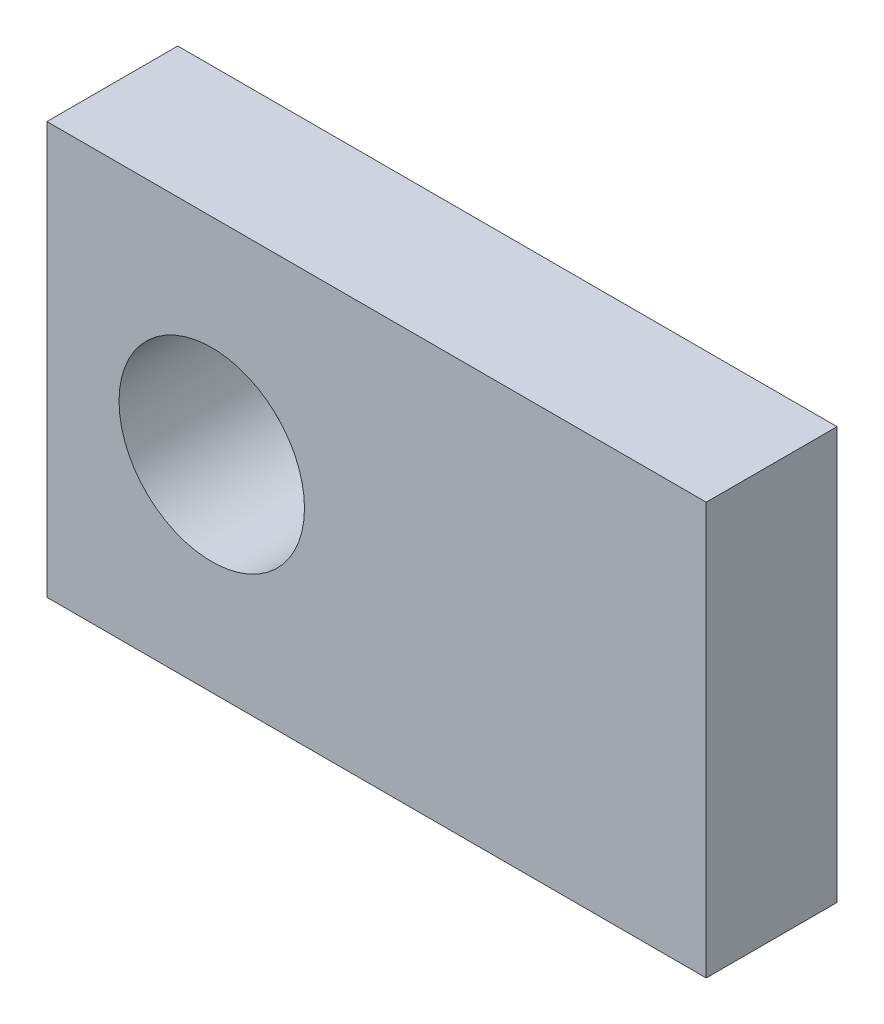
ISO-10303-21;
HEADER;
FILE_DESCRIPTION(('STEP AP214'),'2;1');
FILE_NAME('part.step','',(''),(''),'','','');
FILE_SCHEMA(('AUTOMOTIVE_DESIGN { 1 0 10303 214 1 1 1 1 }'));
ENDSEC;
DATA;
#1=APPLICATION_CONTEXT('core data for automotive mechanical design processes');
#2=APPLICATION_PROTOCOL_DEFINITION('international standard','automotive_design',2000,#1);
#3=PRODUCT_CONTEXT('',#1,'mechanical');
#4=PRODUCT('Part','Part','',(#3));
#5=PRODUCT_RELATED_PRODUCT_CATEGORY('part','',(#4));
#6=PRODUCT_DEFINITION_FORMATION('','',#4);
#7=PRODUCT_DEFINITION_CONTEXT('part definition',#1,'design');
#8=PRODUCT_DEFINITION('design','',#6,#7);
#9=PRODUCT_DEFINITION_SHAPE('','',#8);
#10=(LENGTH_UNIT() NAMED_UNIT(*) SI_UNIT(.MILLI.,.METRE.));
#11=(NAMED_UNIT(*) PLANE_ANGLE_UNIT() SI_UNIT($,.RADIAN.));
#12=(NAMED_UNIT(*) SI_UNIT($,.STERADIAN.) SOLID_ANGLE_UNIT());
#13=UNCERTAINTY_MEASURE_WITH_UNIT(LENGTH_MEASURE(1.E-05),#10,'distance_accuracy_value','');
#14=(GEOMETRIC_REPRESENTATION_CONTEXT(3) GLOBAL_UNCERTAINTY_ASSIGNED_CONTEXT((#13)) GLOBAL_UNIT_ASSIGNED_CONTEXT((#10,
#11,#12)) REPRESENTATION_CONTEXT('',''));
#15=CARTESIAN_POINT('',(0.,0.,0.));
#16=DIRECTION('',(0.,0.,1.));
#17=DIRECTION('',(1.,0.,0.));
#18=AXIS2_PLACEMENT_3D('',#15,#16,#17);
#19=CARTESIAN_POINT('',(-8.,-5.,1.5875));
#20=DIRECTION('',(1.,0.,0.));
#21=DIRECTION('',(0.,0.,-1.));
#22=AXIS2_PLACEMENT_3D('',#19,#20,#21);
#23=PLANE('',#22);
#24=DIRECTION('',(0.,-1.,0.));
#25=VECTOR('',#24,1.);
#26=CARTESIAN_POINT('',(-8.,-5.,-1.5875));
#27=LINE('',#26,#25);
#28=CARTESIAN_POINT('',(-8.,5.,-1.5875));
#29=VERTEX_POINT('',#28);
#30=CARTESIAN_POINT('',(-8.,-5.,-1.5875));
#31=VERTEX_POINT('',#30);
#32=EDGE_CURVE('E113',#29,#31,#27,.T.);
#33=ORIENTED_EDGE('',*,*,#32,.T.);
#34=DIRECTION('',(0.,0.,-1.));
#35=VECTOR('',#34,1.);
#36=CARTESIAN_POINT('',(-8.,-5.,1.5875));
#37=LINE('',#36,#35);
#38=CARTESIAN_POINT('',(-8.,-5.,1.5875));
#39=VERTEX_POINT('',#38);
#40=EDGE_CURVE('E11',#39,#31,#37,.T.);
#41=ORIENTED_EDGE('',*,*,#40,.F.);
#42=DIRECTION('',(0.,-1.,0.));
#43=VECTOR('',#42,1.);
#44=CARTESIAN_POINT('',(-8.,-5.,1.5875));
#45=LINE('',#44,#43);
#46=CARTESIAN_POINT('',(-8.,5.,1.5875));
#47=VERTEX_POINT('',#46);
#48=EDGE_CURVE('E97',#47,#39,#45,.T.);
#49=ORIENTED_EDGE('',*,*,#48,.F.);
#50=DIRECTION('',(0.,0.,-1.));
#51=VECTOR('',#50,1.);
#52=CARTESIAN_POINT('',(-8.,5.,1.5875));
#53=LINE('',#52,#51);
#54=EDGE_CURVE('E109',#47,#29,#53,.T.);
#55=ORIENTED_EDGE('',*,*,#54,.T.);
#56=EDGE_LOOP('',(#33,#41,#49,#55));
#57=FACE_BOUND('',#56,.T.);
#58=ADVANCED_FACE('F45',(#57),#23,.F.);
#59=CARTESIAN_POINT('',(8.,-5.,1.5875));
#60=DIRECTION('',(0.,1.,0.));
#61=DIRECTION('',(-1.,0.,0.));
#62=AXIS2_PLACEMENT_3D('',#59,#60,#61);
#63=PLANE('',#62);
#64=DIRECTION('',(1.,0.,0.));
#65=VECTOR('',#64,1.);
#66=CARTESIAN_POINT('',(8.,-5.,-1.5875));
#67=LINE('',#66,#65);
#68=CARTESIAN_POINT('',(8.,-5.,-1.5875));
#69=VERTEX_POINT('',#68);
#70=EDGE_CURVE('E102',#31,#69,#67,.T.);
#71=ORIENTED_EDGE('',*,*,#70,.T.);
#72=DIRECTION('',(0.,0.,-1.));
#73=VECTOR('',#72,1.);
#74=CARTESIAN_POINT('',(8.,-5.,1.5875));
#75=LINE('',#74,#73);
#76=CARTESIAN_POINT('',(8.,-5.,1.5875));
#77=VERTEX_POINT('',#76);
#78=EDGE_CURVE('E54',#77,#69,#75,.T.);
#79=ORIENTED_EDGE('',*,*,#78,.F.);
#80=DIRECTION('',(1.,0.,0.));
#81=VECTOR('',#80,1.);
#82=CARTESIAN_POINT('',(8.,-5.,1.5875));
#83=LINE('',#82,#81);
#84=EDGE_CURVE('E92',#39,#77,#83,.T.);
#85=ORIENTED_EDGE('',*,*,#84,.F.);
#86=ORIENTED_EDGE('',*,*,#40,.T.);
#87=EDGE_LOOP('',(#71,#79,#85,#86));
#88=FACE_BOUND('',#87,.T.);
#89=ADVANCED_FACE('F101',(#88),#63,.F.);
#90=CARTESIAN_POINT('',(8.,-5.,1.5875));
#91=DIRECTION('',(-1.,0.,0.));
#92=DIRECTION('',(0.,0.,1.));
#93=AXIS2_PLACEMENT_3D('',#90,#91,#92);
#94=PLANE('',#93);
#95=DIRECTION('',(0.,1.,0.));
#96=VECTOR('',#95,1.);
#97=CARTESIAN_POINT('',(8.,-5.,-1.5875));
#98=LINE('',#97,#96);
#99=CARTESIAN_POINT('',(8.,5.,-1.5875));
#100=VERTEX_POINT('',#99);
#101=EDGE_CURVE('E79',#69,#100,#98,.T.);
#102=ORIENTED_EDGE('',*,*,#101,.T.);
#103=DIRECTION('',(0.,0.,-1.));
#104=VECTOR('',#103,1.);
#105=CARTESIAN_POINT('',(8.,5.,1.5875));
#106=LINE('',#105,#104);
#107=CARTESIAN_POINT('',(8.,5.,1.5875));
#108=VERTEX_POINT('',#107);
#109=EDGE_CURVE('E104',#108,#100,#106,.T.);
#110=ORIENTED_EDGE('',*,*,#109,.F.);
#111=DIRECTION('',(0.,1.,0.));
#112=VECTOR('',#111,1.);
#113=CARTESIAN_POINT('',(8.,-5.,1.5875));
#114=LINE('',#113,#112);
#115=EDGE_CURVE('E95',#77,#108,#114,.T.);
#116=ORIENTED_EDGE('',*,*,#115,.F.);
#117=ORIENTED_EDGE('',*,*,#78,.T.);
#118=EDGE_LOOP('',(#102,#110,#116,#117));
#119=FACE_BOUND('',#118,.T.);
#120=ADVANCED_FACE('F105',(#119),#94,.F.);
#121=CARTESIAN_POINT('',(8.,5.,1.5875));
#122=DIRECTION('',(0.,-1.,0.));
#123=DIRECTION('',(1.,0.,0.));
#124=AXIS2_PLACEMENT_3D('',#121,#122,#123);
#125=PLANE('',#124);
#126=DIRECTION('',(-1.,0.,0.));
#127=VECTOR('',#126,1.);
#128=CARTESIAN_POINT('',(8.,5.,-1.5875));
#129=LINE('',#128,#127);
#130=EDGE_CURVE('E85',#100,#29,#129,.T.);
#131=ORIENTED_EDGE('',*,*,#130,.T.);
#132=ORIENTED_EDGE('',*,*,#54,.F.);
#133=DIRECTION('',(-1.,0.,0.));
#134=VECTOR('',#133,1.);
#135=CARTESIAN_POINT('',(8.,5.,1.5875));
#136=LINE('',#135,#134);
#137=EDGE_CURVE('E62',#108,#47,#136,.T.);
#138=ORIENTED_EDGE('',*,*,#137,.F.);
#139=ORIENTED_EDGE('',*,*,#109,.T.);
#140=EDGE_LOOP('',(#131,#132,#138,#139));
#141=FACE_BOUND('',#140,.T.);
#142=ADVANCED_FACE('F127',(#141),#125,.F.);
#143=CARTESIAN_POINT('',(0.,0.,1.5875));
#144=DIRECTION('',(0.,0.,1.));
#145=DIRECTION('',(1.,0.,0.));
#146=AXIS2_PLACEMENT_3D('',#143,#144,#145);
#147=PLANE('',#146);
#148=CARTESIAN_POINT('',(-4.,0.,1.5875));
#149=DIRECTION('',(0.,0.,1.));
#150=DIRECTION('',(1.,0.,0.));
#151=AXIS2_PLACEMENT_3D('',#148,#149,#150);
#152=CIRCLE('',#151,2.24999999999999);
#153=CARTESIAN_POINT('',(-1.75000000000001,0.,1.5875));
#154=VERTEX_POINT('',#153);
#155=EDGE_CURVE('E137',#154,#154,#152,.T.);
#156=ORIENTED_EDGE('',*,*,#155,.F.);
#157=EDGE_LOOP('',(#156));
#158=FACE_BOUND('',#157,.T.);
#159=ORIENTED_EDGE('',*,*,#48,.T.);
#160=ORIENTED_EDGE('',*,*,#84,.T.);
#161=ORIENTED_EDGE('',*,*,#115,.T.);
#162=ORIENTED_EDGE('',*,*,#137,.T.);
#163=EDGE_LOOP('',(#159,#160,#161,#162));
#164=FACE_BOUND('',#163,.T.);
#165=ADVANCED_FACE('F93',(#158,#164),#147,.T.);
#166=CARTESIAN_POINT('',(0.,0.,-1.5875));
#167=DIRECTION('',(0.,0.,1.));
#168=DIRECTION('',(1.,0.,0.));
#169=AXIS2_PLACEMENT_3D('',#166,#167,#168);
#170=PLANE('',#169);
#171=CARTESIAN_POINT('',(-4.,0.,-1.5875));
#172=DIRECTION('',(0.,0.,1.));
#173=DIRECTION('',(1.,0.,0.));
#174=AXIS2_PLACEMENT_3D('',#171,#172,#173);
#175=CIRCLE('',#174,2.25);
#176=CARTESIAN_POINT('',(-1.75,0.,-1.5875));
#177=VERTEX_POINT('',#176);
#178=EDGE_CURVE('E117',#177,#177,#175,.T.);
#179=ORIENTED_EDGE('',*,*,#178,.T.);
#180=EDGE_LOOP('',(#179));
#181=FACE_BOUND('',#180,.T.);
#182=ORIENTED_EDGE('',*,*,#32,.F.);
#183=ORIENTED_EDGE('',*,*,#130,.F.);
#184=ORIENTED_EDGE('',*,*,#101,.F.);
#185=ORIENTED_EDGE('',*,*,#70,.F.);
#186=EDGE_LOOP('',(#182,#183,#184,#185));
#187=FACE_BOUND('',#186,.T.);
#188=ADVANCED_FACE('F130',(#181,#187),#170,.F.);
#189=CARTESIAN_POINT('',(-4.,0.,1.5875));
#190=DIRECTION('',(0.,0.,1.));
#191=DIRECTION('',(1.,0.,0.));
#192=AXIS2_PLACEMENT_3D('',#189,#190,#191);
#193=CYLINDRICAL_SURFACE('',#192,2.24999999999999);
#194=ORIENTED_EDGE('',*,*,#178,.F.);
#195=EDGE_LOOP('',(#194));
#196=FACE_BOUND('',#195,.T.);
#197=ORIENTED_EDGE('',*,*,#155,.T.);
#198=EDGE_LOOP('',(#197));
#199=FACE_BOUND('',#198,.T.);
#200=ADVANCED_FACE('F142',(#196,#199),#193,.F.);
#201=CLOSED_SHELL('',(#58,#89,#120,#142,#165,#188,#200));
#202=MANIFOLD_SOLID_BREP('B2',#201);
#203=ADVANCED_BREP_SHAPE_REPRESENTATION('',(#18,#202),#14);
#204=SHAPE_DEFINITION_REPRESENTATION(#9,#203);
ENDSEC;
END-ISO-10303-21;
